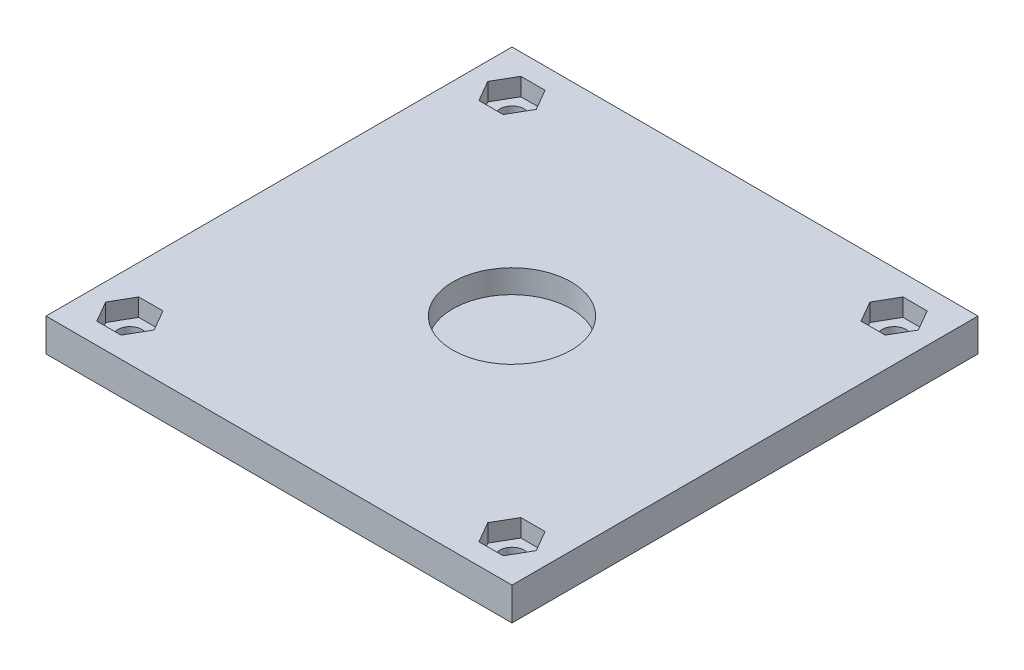
ISO-10303-21;
HEADER;
FILE_DESCRIPTION(('STEP AP214'),'2;1');
FILE_NAME('part.step','',(''),(''),'','','');
FILE_SCHEMA(('AUTOMOTIVE_DESIGN { 1 0 10303 214 1 1 1 1 }'));
ENDSEC;
DATA;
#1=APPLICATION_CONTEXT('core data for automotive mechanical design processes');
#2=APPLICATION_PROTOCOL_DEFINITION('international standard','automotive_design',2000,#1);
#3=PRODUCT_CONTEXT('',#1,'mechanical');
#4=PRODUCT('Part','Part','',(#3));
#5=PRODUCT_RELATED_PRODUCT_CATEGORY('part','',(#4));
#6=PRODUCT_DEFINITION_FORMATION('','',#4);
#7=PRODUCT_DEFINITION_CONTEXT('part definition',#1,'design');
#8=PRODUCT_DEFINITION('design','',#6,#7);
#9=PRODUCT_DEFINITION_SHAPE('','',#8);
#10=(LENGTH_UNIT() NAMED_UNIT(*) SI_UNIT(.MILLI.,.METRE.));
#11=(NAMED_UNIT(*) PLANE_ANGLE_UNIT() SI_UNIT($,.RADIAN.));
#12=(NAMED_UNIT(*) SI_UNIT($,.STERADIAN.) SOLID_ANGLE_UNIT());
#13=UNCERTAINTY_MEASURE_WITH_UNIT(LENGTH_MEASURE(1.E-05),#10,'distance_accuracy_value','');
#14=(GEOMETRIC_REPRESENTATION_CONTEXT(3) GLOBAL_UNCERTAINTY_ASSIGNED_CONTEXT((#13)) GLOBAL_UNIT_ASSIGNED_CONTEXT((#10,
#11,#12)) REPRESENTATION_CONTEXT('',''));
#15=CARTESIAN_POINT('',(0.,0.,0.));
#16=DIRECTION('',(0.,0.,1.));
#17=DIRECTION('',(1.,0.,0.));
#18=AXIS2_PLACEMENT_3D('',#15,#16,#17);
#19=CARTESIAN_POINT('',(8.1303580901857,4.476,26.0013129973475));
#20=DIRECTION('',(0.,0.,-1.));
#21=DIRECTION('',(-1.,0.,0.));
#22=AXIS2_PLACEMENT_3D('',#19,#20,#21);
#23=PLANE('',#22);
#24=DIRECTION('',(1.,0.,0.));
#25=VECTOR('',#24,1.);
#26=CARTESIAN_POINT('',(8.1303580901857,0.,26.0013129973475));
#27=LINE('',#26,#25);
#28=CARTESIAN_POINT('',(8.1303580901857,0.,26.0013129973475));
#29=VERTEX_POINT('',#28);
#30=CARTESIAN_POINT('',(71.6303580901857,0.,26.0013129973475));
#31=VERTEX_POINT('',#30);
#32=EDGE_CURVE('E395',#29,#31,#27,.T.);
#33=ORIENTED_EDGE('',*,*,#32,.T.);
#34=DIRECTION('',(0.,-1.,0.));
#35=VECTOR('',#34,1.);
#36=CARTESIAN_POINT('',(71.6303580901857,4.476,26.0013129973475));
#37=LINE('',#36,#35);
#38=CARTESIAN_POINT('',(71.6303580901857,4.476,26.0013129973475));
#39=VERTEX_POINT('',#38);
#40=EDGE_CURVE('E41',#39,#31,#37,.T.);
#41=ORIENTED_EDGE('',*,*,#40,.F.);
#42=DIRECTION('',(1.,0.,0.));
#43=VECTOR('',#42,1.);
#44=CARTESIAN_POINT('',(8.1303580901857,4.476,26.0013129973475));
#45=LINE('',#44,#43);
#46=CARTESIAN_POINT('',(8.1303580901857,4.476,26.0013129973475));
#47=VERTEX_POINT('',#46);
#48=EDGE_CURVE('E409',#47,#39,#45,.T.);
#49=ORIENTED_EDGE('',*,*,#48,.F.);
#50=DIRECTION('',(0.,-1.,0.));
#51=VECTOR('',#50,1.);
#52=CARTESIAN_POINT('',(8.1303580901857,4.476,26.0013129973475));
#53=LINE('',#52,#51);
#54=EDGE_CURVE('E11',#47,#29,#53,.T.);
#55=ORIENTED_EDGE('',*,*,#54,.T.);
#56=EDGE_LOOP('',(#33,#41,#49,#55));
#57=FACE_BOUND('',#56,.T.);
#58=ADVANCED_FACE('F33',(#57),#23,.F.);
#59=CARTESIAN_POINT('',(71.6303580901857,4.476,-15.9086870026524));
#60=DIRECTION('',(-1.,0.,0.));
#61=DIRECTION('',(0.,0.,1.));
#62=AXIS2_PLACEMENT_3D('',#59,#60,#61);
#63=PLANE('',#62);
#64=DIRECTION('',(0.,0.,-1.));
#65=VECTOR('',#64,1.);
#66=CARTESIAN_POINT('',(71.6303580901857,0.,-15.9086870026524));
#67=LINE('',#66,#65);
#68=CARTESIAN_POINT('',(71.6303580901857,0.,-37.4986870026525));
#69=VERTEX_POINT('',#68);
#70=EDGE_CURVE('E420',#31,#69,#67,.T.);
#71=ORIENTED_EDGE('',*,*,#70,.T.);
#72=DIRECTION('',(0.,-1.,0.));
#73=VECTOR('',#72,1.);
#74=CARTESIAN_POINT('',(71.6303580901857,4.476,-37.4986870026525));
#75=LINE('',#74,#73);
#76=CARTESIAN_POINT('',(71.6303580901857,4.476,-37.4986870026525));
#77=VERTEX_POINT('',#76);
#78=EDGE_CURVE('E428',#77,#69,#75,.T.);
#79=ORIENTED_EDGE('',*,*,#78,.F.);
#80=DIRECTION('',(0.,0.,-1.));
#81=VECTOR('',#80,1.);
#82=CARTESIAN_POINT('',(71.6303580901857,4.476,26.0013129973475));
#83=LINE('',#82,#81);
#84=EDGE_CURVE('E412',#39,#77,#83,.T.);
#85=ORIENTED_EDGE('',*,*,#84,.F.);
#86=ORIENTED_EDGE('',*,*,#40,.T.);
#87=EDGE_LOOP('',(#71,#79,#85,#86));
#88=FACE_BOUND('',#87,.T.);
#89=ADVANCED_FACE('F494',(#88),#63,.F.);
#90=CARTESIAN_POINT('',(71.6303580901857,4.476,-37.4986870026525));
#91=DIRECTION('',(0.,0.,1.));
#92=DIRECTION('',(1.,0.,0.));
#93=AXIS2_PLACEMENT_3D('',#90,#91,#92);
#94=PLANE('',#93);
#95=DIRECTION('',(-1.,0.,0.));
#96=VECTOR('',#95,1.);
#97=CARTESIAN_POINT('',(71.6303580901857,0.,-37.4986870026525));
#98=LINE('',#97,#96);
#99=CARTESIAN_POINT('',(8.13035809018569,0.,-37.4986870026525));
#100=VERTEX_POINT('',#99);
#101=EDGE_CURVE('E422',#69,#100,#98,.T.);
#102=ORIENTED_EDGE('',*,*,#101,.T.);
#103=DIRECTION('',(0.,-1.,0.));
#104=VECTOR('',#103,1.);
#105=CARTESIAN_POINT('',(8.13035809018569,4.476,-37.4986870026525));
#106=LINE('',#105,#104);
#107=CARTESIAN_POINT('',(8.13035809018569,4.476,-37.4986870026525));
#108=VERTEX_POINT('',#107);
#109=EDGE_CURVE('E417',#108,#100,#106,.T.);
#110=ORIENTED_EDGE('',*,*,#109,.F.);
#111=DIRECTION('',(-1.,0.,0.));
#112=VECTOR('',#111,1.);
#113=CARTESIAN_POINT('',(71.6303580901857,4.476,-37.4986870026525));
#114=LINE('',#113,#112);
#115=EDGE_CURVE('E414',#77,#108,#114,.T.);
#116=ORIENTED_EDGE('',*,*,#115,.F.);
#117=ORIENTED_EDGE('',*,*,#78,.T.);
#118=EDGE_LOOP('',(#102,#110,#116,#117));
#119=FACE_BOUND('',#118,.T.);
#120=ADVANCED_FACE('F499',(#119),#94,.F.);
#121=CARTESIAN_POINT('',(8.13035809018569,4.476,19.6513129973474));
#122=DIRECTION('',(1.,0.,0.));
#123=DIRECTION('',(0.,0.,-1.));
#124=AXIS2_PLACEMENT_3D('',#121,#122,#123);
#125=PLANE('',#124);
#126=DIRECTION('',(0.,0.,1.));
#127=VECTOR('',#126,1.);
#128=CARTESIAN_POINT('',(8.13035809018569,0.,19.6513129973474));
#129=LINE('',#128,#127);
#130=EDGE_CURVE('E410',#100,#29,#129,.T.);
#131=ORIENTED_EDGE('',*,*,#130,.T.);
#132=ORIENTED_EDGE('',*,*,#54,.F.);
#133=DIRECTION('',(0.,0.,1.));
#134=VECTOR('',#133,1.);
#135=CARTESIAN_POINT('',(8.13035809018569,4.476,19.6513129973474));
#136=LINE('',#135,#134);
#137=EDGE_CURVE('E406',#108,#47,#136,.T.);
#138=ORIENTED_EDGE('',*,*,#137,.F.);
#139=ORIENTED_EDGE('',*,*,#109,.T.);
#140=EDGE_LOOP('',(#131,#132,#138,#139));
#141=FACE_BOUND('',#140,.T.);
#142=ADVANCED_FACE('F511',(#141),#125,.F.);
#143=CARTESIAN_POINT('',(0.,4.476,0.));
#144=DIRECTION('',(0.,1.,0.));
#145=DIRECTION('',(0.,0.,1.));
#146=AXIS2_PLACEMENT_3D('',#143,#144,#145);
#147=PLANE('',#146);
#148=CARTESIAN_POINT('',(39.8803580901857,4.476,-5.74868700265251));
#149=DIRECTION('',(0.,1.,0.));
#150=DIRECTION('',(0.,0.,1.));
#151=AXIS2_PLACEMENT_3D('',#148,#149,#150);
#152=CIRCLE('',#151,8.0645);
#153=CARTESIAN_POINT('',(39.8803580901857,4.476,2.31581299734749));
#154=VERTEX_POINT('',#153);
#155=EDGE_CURVE('E893',#154,#154,#152,.T.);
#156=ORIENTED_EDGE('',*,*,#155,.F.);
#157=EDGE_LOOP('',(#156));
#158=FACE_BOUND('',#157,.T.);
#159=DIRECTION('',(0.499999999999999,0.,-0.866025403784439));
#160=VECTOR('',#159,1.);
#161=CARTESIAN_POINT('',(21.6429173613664,4.476,12.4955441646337));
#162=LINE('',#161,#160);
#163=CARTESIAN_POINT('',(15.4951364843956,4.476,23.1438129973475));
#164=VERTEX_POINT('',#163);
#165=CARTESIAN_POINT('',(17.1449148786049,4.476,20.2863129973475));
#166=VERTEX_POINT('',#165);
#167=EDGE_CURVE('E49',#164,#166,#162,.T.);
#168=ORIENTED_EDGE('',*,*,#167,.F.);
#169=DIRECTION('',(1.,0.,0.));
#170=VECTOR('',#169,1.);
#171=CARTESIAN_POINT('',(0.,4.476,23.1438129973475));
#172=LINE('',#171,#170);
#173=CARTESIAN_POINT('',(12.1955796959769,4.476,23.1438129973475));
#174=VERTEX_POINT('',#173);
#175=EDGE_CURVE('E229',#174,#164,#172,.T.);
#176=ORIENTED_EDGE('',*,*,#175,.F.);
#177=DIRECTION('',(0.5,0.,0.866025403784439));
#178=VECTOR('',#177,1.);
#179=CARTESIAN_POINT('',(-0.874880226087025,4.476,0.505112334040024));
#180=LINE('',#179,#178);
#181=CARTESIAN_POINT('',(10.5458013017675,4.476,20.2863129973475));
#182=VERTEX_POINT('',#181);
#183=EDGE_CURVE('E234',#182,#174,#180,.T.);
#184=ORIENTED_EDGE('',*,*,#183,.F.);
#185=DIRECTION('',(-0.5,0.,0.866025403784439));
#186=VECTOR('',#185,1.);
#187=CARTESIAN_POINT('',(16.6935821787383,4.476,9.63804416463371));
#188=LINE('',#187,#186);
#189=CARTESIAN_POINT('',(12.1955796959769,4.476,17.4288129973475));
#190=VERTEX_POINT('',#189);
#191=EDGE_CURVE('E466',#190,#182,#188,.T.);
#192=ORIENTED_EDGE('',*,*,#191,.F.);
#193=DIRECTION('',(-1.,0.,0.));
#194=VECTOR('',#193,1.);
#195=CARTESIAN_POINT('',(0.,4.476,17.4288129973475));
#196=LINE('',#195,#194);
#197=CARTESIAN_POINT('',(15.4951364843956,4.476,17.4288129973475));
#198=VERTEX_POINT('',#197);
#199=EDGE_CURVE('E246',#198,#190,#196,.T.);
#200=ORIENTED_EDGE('',*,*,#199,.F.);
#201=DIRECTION('',(-0.5,0.,-0.866025403784439));
#202=VECTOR('',#201,1.);
#203=CARTESIAN_POINT('',(4.07445495654103,4.476,-2.35238766595997));
#204=LINE('',#203,#202);
#205=EDGE_CURVE('E241',#166,#198,#204,.T.);
#206=ORIENTED_EDGE('',*,*,#205,.F.);
#207=EDGE_LOOP('',(#168,#176,#184,#192,#200,#206));
#208=FACE_BOUND('',#207,.T.);
#209=DIRECTION('',(0.500000000000001,0.,-0.866025403784438));
#210=VECTOR('',#209,1.);
#211=CARTESIAN_POINT('',(60.6954173613663,4.476,35.0425155521616));
#212=LINE('',#211,#210);
#213=CARTESIAN_POINT('',(67.5651364843956,4.476,23.1438129973475));
#214=VERTEX_POINT('',#213);
#215=CARTESIAN_POINT('',(69.2149148786049,4.476,20.2863129973475));
#216=VERTEX_POINT('',#215);
#217=EDGE_CURVE('E57',#214,#216,#212,.T.);
#218=ORIENTED_EDGE('',*,*,#217,.F.);
#219=DIRECTION('',(1.,0.,0.));
#220=VECTOR('',#219,1.);
#221=CARTESIAN_POINT('',(0.,4.476,23.1438129973475));
#222=LINE('',#221,#220);
#223=CARTESIAN_POINT('',(64.2655796959769,4.476,23.1438129973475));
#224=VERTEX_POINT('',#223);
#225=EDGE_CURVE('E276',#224,#214,#222,.T.);
#226=ORIENTED_EDGE('',*,*,#225,.F.);
#227=DIRECTION('',(0.500000000000002,0.,0.866025403784437));
#228=VECTOR('',#227,1.);
#229=CARTESIAN_POINT('',(38.1776197739128,4.476,-22.0418590534879));
#230=LINE('',#229,#228);
#231=CARTESIAN_POINT('',(62.6158013017675,4.476,20.2863129973475));
#232=VERTEX_POINT('',#231);
#233=EDGE_CURVE('E279',#232,#224,#230,.T.);
#234=ORIENTED_EDGE('',*,*,#233,.F.);
#235=DIRECTION('',(-0.500000000000002,0.,0.866025403784437));
#236=VECTOR('',#235,1.);
#237=CARTESIAN_POINT('',(55.7460821787382,4.476,32.1850155521617));
#238=LINE('',#237,#236);
#239=CARTESIAN_POINT('',(64.2655796959769,4.476,17.4288129973475));
#240=VERTEX_POINT('',#239);
#241=EDGE_CURVE('E283',#240,#232,#238,.T.);
#242=ORIENTED_EDGE('',*,*,#241,.F.);
#243=DIRECTION('',(-1.,0.,0.));
#244=VECTOR('',#243,1.);
#245=CARTESIAN_POINT('',(0.,4.476,17.4288129973475));
#246=LINE('',#245,#244);
#247=CARTESIAN_POINT('',(67.5651364843956,4.476,17.4288129973475));
#248=VERTEX_POINT('',#247);
#249=EDGE_CURVE('E286',#248,#240,#246,.T.);
#250=ORIENTED_EDGE('',*,*,#249,.F.);
#251=DIRECTION('',(-0.5,0.,-0.866025403784439));
#252=VECTOR('',#251,1.);
#253=CARTESIAN_POINT('',(43.126954956541,4.476,-24.8993590534878));
#254=LINE('',#253,#252);
#255=EDGE_CURVE('E289',#216,#248,#254,.T.);
#256=ORIENTED_EDGE('',*,*,#255,.F.);
#257=EDGE_LOOP('',(#218,#226,#234,#242,#250,#256));
#258=FACE_BOUND('',#257,.T.);
#259=DIRECTION('',(0.499999999999998,0.,-0.86602540378444));
#260=VECTOR('',#259,1.);
#261=CARTESIAN_POINT('',(38.1484459738383,4.476,22.0250155521613));
#262=LINE('',#261,#260);
#263=CARTESIAN_POINT('',(67.565136484395,4.476,-28.9261870026525));
#264=VERTEX_POINT('',#263);
#265=CARTESIAN_POINT('',(69.2149148786044,4.476,-31.7836870026525));
#266=VERTEX_POINT('',#265);
#267=EDGE_CURVE('E339',#264,#266,#262,.T.);
#268=ORIENTED_EDGE('',*,*,#267,.F.);
#269=DIRECTION('',(1.,0.,0.));
#270=VECTOR('',#269,1.);
#271=CARTESIAN_POINT('',(0.,4.476,-28.9261870026525));
#272=LINE('',#271,#270);
#273=CARTESIAN_POINT('',(64.2655796959763,4.476,-28.9261870026525));
#274=VERTEX_POINT('',#273);
#275=EDGE_CURVE('E323',#274,#264,#272,.T.);
#276=ORIENTED_EDGE('',*,*,#275,.F.);
#277=DIRECTION('',(0.499999999999999,0.,0.866025403784439));
#278=VECTOR('',#277,1.);
#279=CARTESIAN_POINT('',(60.7245911614404,4.476,-35.0593590534875));
#280=LINE('',#279,#278);
#281=CARTESIAN_POINT('',(62.615801301767,4.476,-31.7836870026525));
#282=VERTEX_POINT('',#281);
#283=EDGE_CURVE('E326',#282,#274,#280,.T.);
#284=ORIENTED_EDGE('',*,*,#283,.F.);
#285=DIRECTION('',(-0.499999999999999,0.,0.866025403784439));
#286=VECTOR('',#285,1.);
#287=CARTESIAN_POINT('',(33.1991107912101,4.476,19.1675155521613));
#288=LINE('',#287,#286);
#289=CARTESIAN_POINT('',(64.2655796959763,4.476,-34.6411870026525));
#290=VERTEX_POINT('',#289);
#291=EDGE_CURVE('E330',#290,#282,#288,.T.);
#292=ORIENTED_EDGE('',*,*,#291,.F.);
#293=DIRECTION('',(-1.,0.,0.));
#294=VECTOR('',#293,1.);
#295=CARTESIAN_POINT('',(0.,4.476,-34.6411870026525));
#296=LINE('',#295,#294);
#297=CARTESIAN_POINT('',(67.565136484395,4.476,-34.6411870026525));
#298=VERTEX_POINT('',#297);
#299=EDGE_CURVE('E333',#298,#290,#296,.T.);
#300=ORIENTED_EDGE('',*,*,#299,.F.);
#301=DIRECTION('',(-0.5,0.,-0.866025403784439));
#302=VECTOR('',#301,1.);
#303=CARTESIAN_POINT('',(65.6739263440685,4.476,-37.9168590534876));
#304=LINE('',#303,#302);
#305=EDGE_CURVE('E336',#266,#298,#304,.T.);
#306=ORIENTED_EDGE('',*,*,#305,.F.);
#307=EDGE_LOOP('',(#268,#276,#284,#292,#300,#306));
#308=FACE_BOUND('',#307,.T.);
#309=DIRECTION('',(1.,0.,0.));
#310=VECTOR('',#309,1.);
#311=CARTESIAN_POINT('',(0.,4.476,-28.9261870026525));
#312=LINE('',#311,#310);
#313=CARTESIAN_POINT('',(12.1955796959763,4.476,-28.9261870026525));
#314=VERTEX_POINT('',#313);
#315=CARTESIAN_POINT('',(15.495136484395,4.476,-28.9261870026525));
#316=VERTEX_POINT('',#315);
#317=EDGE_CURVE('E341',#314,#316,#312,.T.);
#318=ORIENTED_EDGE('',*,*,#317,.F.);
#319=DIRECTION('',(0.5,0.,0.866025403784439));
#320=VECTOR('',#319,1.);
#321=CARTESIAN_POINT('',(21.6720911614404,4.476,-12.5123876659597));
#322=LINE('',#321,#320);
#323=CARTESIAN_POINT('',(10.545801301767,4.476,-31.7836870026525));
#324=VERTEX_POINT('',#323);
#325=EDGE_CURVE('E362',#324,#314,#322,.T.);
#326=ORIENTED_EDGE('',*,*,#325,.F.);
#327=DIRECTION('',(-0.5,0.,0.866025403784439));
#328=VECTOR('',#327,1.);
#329=CARTESIAN_POINT('',(-5.85338920878995,4.476,-3.37945583536653));
#330=LINE('',#329,#328);
#331=CARTESIAN_POINT('',(12.1955796959763,4.476,-34.6411870026525));
#332=VERTEX_POINT('',#331);
#333=EDGE_CURVE('E388',#332,#324,#330,.T.);
#334=ORIENTED_EDGE('',*,*,#333,.F.);
#335=DIRECTION('',(-1.,0.,0.));
#336=VECTOR('',#335,1.);
#337=CARTESIAN_POINT('',(0.,4.476,-34.6411870026525));
#338=LINE('',#337,#336);
#339=CARTESIAN_POINT('',(15.4951364843951,4.476,-34.6411870026525));
#340=VERTEX_POINT('',#339);
#341=EDGE_CURVE('E385',#340,#332,#338,.T.);
#342=ORIENTED_EDGE('',*,*,#341,.F.);
#343=DIRECTION('',(-0.5,0.,-0.866025403784439));
#344=VECTOR('',#343,1.);
#345=CARTESIAN_POINT('',(26.6214263440685,4.476,-15.3698876659597));
#346=LINE('',#345,#344);
#347=CARTESIAN_POINT('',(17.1449148786044,4.476,-31.7836870026525));
#348=VERTEX_POINT('',#347);
#349=EDGE_CURVE('E382',#348,#340,#346,.T.);
#350=ORIENTED_EDGE('',*,*,#349,.F.);
#351=DIRECTION('',(0.499999999999999,0.,-0.866025403784439));
#352=VECTOR('',#351,1.);
#353=CARTESIAN_POINT('',(-0.904054026161858,4.476,-0.521955835366512));
#354=LINE('',#353,#352);
#355=EDGE_CURVE('E379',#316,#348,#354,.T.);
#356=ORIENTED_EDGE('',*,*,#355,.F.);
#357=EDGE_LOOP('',(#318,#326,#334,#342,#350,#356));
#358=FACE_BOUND('',#357,.T.);
#359=ORIENTED_EDGE('',*,*,#137,.T.);
#360=ORIENTED_EDGE('',*,*,#48,.T.);
#361=ORIENTED_EDGE('',*,*,#84,.T.);
#362=ORIENTED_EDGE('',*,*,#115,.T.);
#363=EDGE_LOOP('',(#359,#360,#361,#362));
#364=FACE_BOUND('',#363,.T.);
#365=ADVANCED_FACE('F237',(#158,#208,#258,#308,#358,#364),#147,.T.);
#366=CARTESIAN_POINT('',(0.,0.,0.));
#367=DIRECTION('',(0.,1.,0.));
#368=DIRECTION('',(0.,0.,1.));
#369=AXIS2_PLACEMENT_3D('',#366,#367,#368);
#370=PLANE('',#369);
#371=CARTESIAN_POINT('',(13.8453580901862,0.,20.2863129973475));
#372=DIRECTION('',(0.,1.,0.));
#373=DIRECTION('',(0.,0.,1.));
#374=AXIS2_PLACEMENT_3D('',#371,#372,#373);
#375=CIRCLE('',#374,1.65);
#376=CARTESIAN_POINT('',(13.8453580901862,0.,21.9363129973475));
#377=VERTEX_POINT('',#376);
#378=EDGE_CURVE('E451',#377,#377,#375,.T.);
#379=ORIENTED_EDGE('',*,*,#378,.T.);
#380=EDGE_LOOP('',(#379));
#381=FACE_BOUND('',#380,.T.);
#382=CARTESIAN_POINT('',(65.9153580901862,0.,20.2863129973475));
#383=DIRECTION('',(0.,1.,0.));
#384=DIRECTION('',(0.,0.,1.));
#385=AXIS2_PLACEMENT_3D('',#382,#383,#384);
#386=CIRCLE('',#385,1.65);
#387=CARTESIAN_POINT('',(65.9153580901862,0.,21.9363129973475));
#388=VERTEX_POINT('',#387);
#389=EDGE_CURVE('E441',#388,#388,#386,.T.);
#390=ORIENTED_EDGE('',*,*,#389,.T.);
#391=EDGE_LOOP('',(#390));
#392=FACE_BOUND('',#391,.T.);
#393=CARTESIAN_POINT('',(65.9153580901857,0.,-31.7836870026525));
#394=DIRECTION('',(0.,1.,0.));
#395=DIRECTION('',(0.,0.,1.));
#396=AXIS2_PLACEMENT_3D('',#393,#394,#395);
#397=CIRCLE('',#396,1.65);
#398=CARTESIAN_POINT('',(65.9153580901857,0.,-30.1336870026525));
#399=VERTEX_POINT('',#398);
#400=EDGE_CURVE('E438',#399,#399,#397,.T.);
#401=ORIENTED_EDGE('',*,*,#400,.T.);
#402=EDGE_LOOP('',(#401));
#403=FACE_BOUND('',#402,.T.);
#404=CARTESIAN_POINT('',(13.8453580901857,0.,-31.7836870026525));
#405=DIRECTION('',(0.,1.,0.));
#406=DIRECTION('',(0.,0.,1.));
#407=AXIS2_PLACEMENT_3D('',#404,#405,#406);
#408=CIRCLE('',#407,1.65);
#409=CARTESIAN_POINT('',(13.8453580901857,0.,-30.1336870026525));
#410=VERTEX_POINT('',#409);
#411=EDGE_CURVE('E435',#410,#410,#408,.T.);
#412=ORIENTED_EDGE('',*,*,#411,.T.);
#413=EDGE_LOOP('',(#412));
#414=FACE_BOUND('',#413,.T.);
#415=ORIENTED_EDGE('',*,*,#32,.F.);
#416=ORIENTED_EDGE('',*,*,#130,.F.);
#417=ORIENTED_EDGE('',*,*,#101,.F.);
#418=ORIENTED_EDGE('',*,*,#70,.F.);
#419=EDGE_LOOP('',(#415,#416,#417,#418));
#420=FACE_BOUND('',#419,.T.);
#421=ADVANCED_FACE('F513',(#381,#392,#403,#414,#420),#370,.F.);
#422=CARTESIAN_POINT('',(0.,2.063,-28.9261870026525));
#423=DIRECTION('',(0.,0.,1.));
#424=DIRECTION('',(1.,0.,0.));
#425=AXIS2_PLACEMENT_3D('',#422,#423,#424);
#426=PLANE('',#425);
#427=ORIENTED_EDGE('',*,*,#317,.T.);
#428=DIRECTION('',(0.,1.,0.));
#429=VECTOR('',#428,1.);
#430=CARTESIAN_POINT('',(15.495136484395,2.063,-28.9261870026525));
#431=LINE('',#430,#429);
#432=CARTESIAN_POINT('',(15.495136484395,2.063,-28.9261870026525));
#433=VERTEX_POINT('',#432);
#434=EDGE_CURVE('E377',#433,#316,#431,.T.);
#435=ORIENTED_EDGE('',*,*,#434,.F.);
#436=DIRECTION('',(1.,0.,0.));
#437=VECTOR('',#436,1.);
#438=CARTESIAN_POINT('',(0.,2.063,-28.9261870026525));
#439=LINE('',#438,#437);
#440=CARTESIAN_POINT('',(12.1955796959763,2.063,-28.9261870026525));
#441=VERTEX_POINT('',#440);
#442=EDGE_CURVE('E358',#441,#433,#439,.T.);
#443=ORIENTED_EDGE('',*,*,#442,.F.);
#444=DIRECTION('',(0.,1.,0.));
#445=VECTOR('',#444,1.);
#446=CARTESIAN_POINT('',(12.1955796959763,2.063,-28.9261870026525));
#447=LINE('',#446,#445);
#448=EDGE_CURVE('E393',#441,#314,#447,.T.);
#449=ORIENTED_EDGE('',*,*,#448,.T.);
#450=EDGE_LOOP('',(#427,#435,#443,#449));
#451=FACE_BOUND('',#450,.T.);
#452=ADVANCED_FACE('F524',(#451),#426,.F.);
#453=CARTESIAN_POINT('',(21.6720911614404,2.063,-12.5123876659597));
#454=DIRECTION('',(-0.866025403784439,0.,0.5));
#455=DIRECTION('',(0.5,0.,0.866025403784439));
#456=AXIS2_PLACEMENT_3D('',#453,#454,#455);
#457=PLANE('',#456);
#458=ORIENTED_EDGE('',*,*,#325,.T.);
#459=ORIENTED_EDGE('',*,*,#448,.F.);
#460=DIRECTION('',(0.5,0.,0.866025403784439));
#461=VECTOR('',#460,1.);
#462=CARTESIAN_POINT('',(21.6720911614404,2.063,-12.5123876659597));
#463=LINE('',#462,#461);
#464=CARTESIAN_POINT('',(10.545801301767,2.063,-31.7836870026525));
#465=VERTEX_POINT('',#464);
#466=EDGE_CURVE('E374',#465,#441,#463,.T.);
#467=ORIENTED_EDGE('',*,*,#466,.F.);
#468=DIRECTION('',(0.,1.,0.));
#469=VECTOR('',#468,1.);
#470=CARTESIAN_POINT('',(10.545801301767,2.063,-31.7836870026525));
#471=LINE('',#470,#469);
#472=EDGE_CURVE('E396',#465,#324,#471,.T.);
#473=ORIENTED_EDGE('',*,*,#472,.T.);
#474=EDGE_LOOP('',(#458,#459,#467,#473));
#475=FACE_BOUND('',#474,.T.);
#476=ADVANCED_FACE('F531',(#475),#457,.F.);
#477=CARTESIAN_POINT('',(-5.85338920878995,2.063,-3.37945583536653));
#478=DIRECTION('',(-0.866025403784439,0.,-0.5));
#479=DIRECTION('',(-0.5,0.,0.866025403784439));
#480=AXIS2_PLACEMENT_3D('',#477,#478,#479);
#481=PLANE('',#480);
#482=ORIENTED_EDGE('',*,*,#333,.T.);
#483=ORIENTED_EDGE('',*,*,#472,.F.);
#484=DIRECTION('',(-0.5,0.,0.866025403784439));
#485=VECTOR('',#484,1.);
#486=CARTESIAN_POINT('',(-5.85338920878995,2.063,-3.37945583536653));
#487=LINE('',#486,#485);
#488=CARTESIAN_POINT('',(12.1955796959763,2.063,-34.6411870026525));
#489=VERTEX_POINT('',#488);
#490=EDGE_CURVE('E371',#489,#465,#487,.T.);
#491=ORIENTED_EDGE('',*,*,#490,.F.);
#492=DIRECTION('',(0.,1.,0.));
#493=VECTOR('',#492,1.);
#494=CARTESIAN_POINT('',(12.1955796959763,2.063,-34.6411870026525));
#495=LINE('',#494,#493);
#496=EDGE_CURVE('E398',#489,#332,#495,.T.);
#497=ORIENTED_EDGE('',*,*,#496,.T.);
#498=EDGE_LOOP('',(#482,#483,#491,#497));
#499=FACE_BOUND('',#498,.T.);
#500=ADVANCED_FACE('F545',(#499),#481,.F.);
#501=CARTESIAN_POINT('',(0.,2.063,-34.6411870026525));
#502=DIRECTION('',(0.,0.,-1.));
#503=DIRECTION('',(-1.,0.,0.));
#504=AXIS2_PLACEMENT_3D('',#501,#502,#503);
#505=PLANE('',#504);
#506=ORIENTED_EDGE('',*,*,#341,.T.);
#507=ORIENTED_EDGE('',*,*,#496,.F.);
#508=DIRECTION('',(-1.,0.,0.));
#509=VECTOR('',#508,1.);
#510=CARTESIAN_POINT('',(0.,2.063,-34.6411870026525));
#511=LINE('',#510,#509);
#512=CARTESIAN_POINT('',(15.4951364843951,2.063,-34.6411870026525));
#513=VERTEX_POINT('',#512);
#514=EDGE_CURVE('E368',#513,#489,#511,.T.);
#515=ORIENTED_EDGE('',*,*,#514,.F.);
#516=DIRECTION('',(0.,1.,0.));
#517=VECTOR('',#516,1.);
#518=CARTESIAN_POINT('',(15.4951364843951,2.063,-34.6411870026525));
#519=LINE('',#518,#517);
#520=EDGE_CURVE('E400',#513,#340,#519,.T.);
#521=ORIENTED_EDGE('',*,*,#520,.T.);
#522=EDGE_LOOP('',(#506,#507,#515,#521));
#523=FACE_BOUND('',#522,.T.);
#524=ADVANCED_FACE('F541',(#523),#505,.F.);
#525=CARTESIAN_POINT('',(26.6214263440685,2.063,-15.3698876659597));
#526=DIRECTION('',(0.866025403784438,0.,-0.5));
#527=DIRECTION('',(-0.5,0.,-0.866025403784439));
#528=AXIS2_PLACEMENT_3D('',#525,#526,#527);
#529=PLANE('',#528);
#530=ORIENTED_EDGE('',*,*,#349,.T.);
#531=ORIENTED_EDGE('',*,*,#520,.F.);
#532=DIRECTION('',(-0.5,0.,-0.866025403784439));
#533=VECTOR('',#532,1.);
#534=CARTESIAN_POINT('',(26.6214263440685,2.063,-15.3698876659597));
#535=LINE('',#534,#533);
#536=CARTESIAN_POINT('',(17.1449148786044,2.063,-31.7836870026525));
#537=VERTEX_POINT('',#536);
#538=EDGE_CURVE('E365',#537,#513,#535,.T.);
#539=ORIENTED_EDGE('',*,*,#538,.F.);
#540=DIRECTION('',(0.,1.,0.));
#541=VECTOR('',#540,1.);
#542=CARTESIAN_POINT('',(17.1449148786044,2.063,-31.7836870026525));
#543=LINE('',#542,#541);
#544=EDGE_CURVE('E402',#537,#348,#543,.T.);
#545=ORIENTED_EDGE('',*,*,#544,.T.);
#546=EDGE_LOOP('',(#530,#531,#539,#545));
#547=FACE_BOUND('',#546,.T.);
#548=ADVANCED_FACE('F537',(#547),#529,.F.);
#549=CARTESIAN_POINT('',(-0.904054026161858,2.063,-0.521955835366512));
#550=DIRECTION('',(0.866025403784439,0.,0.499999999999999));
#551=DIRECTION('',(0.499999999999999,0.,-0.866025403784439));
#552=AXIS2_PLACEMENT_3D('',#549,#550,#551);
#553=PLANE('',#552);
#554=ORIENTED_EDGE('',*,*,#355,.T.);
#555=ORIENTED_EDGE('',*,*,#544,.F.);
#556=DIRECTION('',(0.499999999999999,0.,-0.866025403784439));
#557=VECTOR('',#556,1.);
#558=CARTESIAN_POINT('',(-0.904054026161858,2.063,-0.521955835366512));
#559=LINE('',#558,#557);
#560=EDGE_CURVE('E361',#433,#537,#559,.T.);
#561=ORIENTED_EDGE('',*,*,#560,.F.);
#562=ORIENTED_EDGE('',*,*,#434,.T.);
#563=EDGE_LOOP('',(#554,#555,#561,#562));
#564=FACE_BOUND('',#563,.T.);
#565=ADVANCED_FACE('F533',(#564),#553,.F.);
#566=CARTESIAN_POINT('',(0.,2.063,0.));
#567=DIRECTION('',(0.,1.,0.));
#568=DIRECTION('',(0.,0.,1.));
#569=AXIS2_PLACEMENT_3D('',#566,#567,#568);
#570=PLANE('',#569);
#571=CARTESIAN_POINT('',(13.8453580901857,2.063,-31.7836870026525));
#572=DIRECTION('',(0.,1.,0.));
#573=DIRECTION('',(0.,0.,1.));
#574=AXIS2_PLACEMENT_3D('',#571,#572,#573);
#575=CIRCLE('',#574,1.65);
#576=CARTESIAN_POINT('',(13.8453580901857,2.063,-30.1336870026525));
#577=VERTEX_POINT('',#576);
#578=EDGE_CURVE('E226',#577,#577,#575,.T.);
#579=ORIENTED_EDGE('',*,*,#578,.F.);
#580=EDGE_LOOP('',(#579));
#581=FACE_BOUND('',#580,.T.);
#582=ORIENTED_EDGE('',*,*,#442,.T.);
#583=ORIENTED_EDGE('',*,*,#560,.T.);
#584=ORIENTED_EDGE('',*,*,#538,.T.);
#585=ORIENTED_EDGE('',*,*,#514,.T.);
#586=ORIENTED_EDGE('',*,*,#490,.T.);
#587=ORIENTED_EDGE('',*,*,#466,.T.);
#588=EDGE_LOOP('',(#582,#583,#584,#585,#586,#587));
#589=FACE_BOUND('',#588,.T.);
#590=ADVANCED_FACE('F536',(#581,#589),#570,.T.);
#591=CARTESIAN_POINT('',(38.1484459738383,2.063,22.0250155521613));
#592=DIRECTION('',(0.86602540378444,0.,0.499999999999998));
#593=DIRECTION('',(0.499999999999998,0.,-0.86602540378444));
#594=AXIS2_PLACEMENT_3D('',#591,#592,#593);
#595=PLANE('',#594);
#596=ORIENTED_EDGE('',*,*,#267,.T.);
#597=DIRECTION('',(0.,1.,0.));
#598=VECTOR('',#597,1.);
#599=CARTESIAN_POINT('',(69.2149148786044,2.063,-31.7836870026525));
#600=LINE('',#599,#598);
#601=CARTESIAN_POINT('',(69.2149148786044,2.063,-31.7836870026525));
#602=VERTEX_POINT('',#601);
#603=EDGE_CURVE('E310',#602,#266,#600,.T.);
#604=ORIENTED_EDGE('',*,*,#603,.F.);
#605=DIRECTION('',(0.499999999999998,0.,-0.86602540378444));
#606=VECTOR('',#605,1.);
#607=CARTESIAN_POINT('',(38.1484459738383,2.063,22.0250155521613));
#608=LINE('',#607,#606);
#609=CARTESIAN_POINT('',(67.565136484395,2.063,-28.9261870026525));
#610=VERTEX_POINT('',#609);
#611=EDGE_CURVE('E327',#610,#602,#608,.T.);
#612=ORIENTED_EDGE('',*,*,#611,.F.);
#613=DIRECTION('',(0.,1.,0.));
#614=VECTOR('',#613,1.);
#615=CARTESIAN_POINT('',(67.565136484395,2.063,-28.9261870026525));
#616=LINE('',#615,#614);
#617=EDGE_CURVE('E293',#610,#264,#616,.T.);
#618=ORIENTED_EDGE('',*,*,#617,.T.);
#619=EDGE_LOOP('',(#596,#604,#612,#618));
#620=FACE_BOUND('',#619,.T.);
#621=ADVANCED_FACE('F555',(#620),#595,.F.);
#622=CARTESIAN_POINT('',(0.,2.063,-28.9261870026525));
#623=DIRECTION('',(0.,0.,1.));
#624=DIRECTION('',(1.,0.,0.));
#625=AXIS2_PLACEMENT_3D('',#622,#623,#624);
#626=PLANE('',#625);
#627=ORIENTED_EDGE('',*,*,#275,.T.);
#628=ORIENTED_EDGE('',*,*,#617,.F.);
#629=DIRECTION('',(1.,0.,0.));
#630=VECTOR('',#629,1.);
#631=CARTESIAN_POINT('',(0.,2.063,-28.9261870026525));
#632=LINE('',#631,#630);
#633=CARTESIAN_POINT('',(64.2655796959763,2.063,-28.9261870026525));
#634=VERTEX_POINT('',#633);
#635=EDGE_CURVE('E313',#634,#610,#632,.T.);
#636=ORIENTED_EDGE('',*,*,#635,.F.);
#637=DIRECTION('',(0.,1.,0.));
#638=VECTOR('',#637,1.);
#639=CARTESIAN_POINT('',(64.2655796959763,2.063,-28.9261870026525));
#640=LINE('',#639,#638);
#641=EDGE_CURVE('E320',#634,#274,#640,.T.);
#642=ORIENTED_EDGE('',*,*,#641,.T.);
#643=EDGE_LOOP('',(#627,#628,#636,#642));
#644=FACE_BOUND('',#643,.T.);
#645=ADVANCED_FACE('F563',(#644),#626,.F.);
#646=CARTESIAN_POINT('',(60.7245911614404,2.063,-35.0593590534875));
#647=DIRECTION('',(-0.866025403784439,0.,0.499999999999999));
#648=DIRECTION('',(0.499999999999999,0.,0.866025403784439));
#649=AXIS2_PLACEMENT_3D('',#646,#647,#648);
#650=PLANE('',#649);
#651=ORIENTED_EDGE('',*,*,#283,.T.);
#652=ORIENTED_EDGE('',*,*,#641,.F.);
#653=DIRECTION('',(0.499999999999999,0.,0.866025403784439));
#654=VECTOR('',#653,1.);
#655=CARTESIAN_POINT('',(60.7245911614404,2.063,-35.0593590534875));
#656=LINE('',#655,#654);
#657=CARTESIAN_POINT('',(62.615801301767,2.063,-31.7836870026525));
#658=VERTEX_POINT('',#657);
#659=EDGE_CURVE('E344',#658,#634,#656,.T.);
#660=ORIENTED_EDGE('',*,*,#659,.F.);
#661=DIRECTION('',(0.,1.,0.));
#662=VECTOR('',#661,1.);
#663=CARTESIAN_POINT('',(62.615801301767,2.063,-31.7836870026525));
#664=LINE('',#663,#662);
#665=EDGE_CURVE('E318',#658,#282,#664,.T.);
#666=ORIENTED_EDGE('',*,*,#665,.T.);
#667=EDGE_LOOP('',(#651,#652,#660,#666));
#668=FACE_BOUND('',#667,.T.);
#669=ADVANCED_FACE('F566',(#668),#650,.F.);
#670=CARTESIAN_POINT('',(33.1991107912101,2.063,19.1675155521613));
#671=DIRECTION('',(-0.866025403784439,0.,-0.499999999999999));
#672=DIRECTION('',(-0.499999999999999,0.,0.866025403784439));
#673=AXIS2_PLACEMENT_3D('',#670,#671,#672);
#674=PLANE('',#673);
#675=ORIENTED_EDGE('',*,*,#291,.T.);
#676=ORIENTED_EDGE('',*,*,#665,.F.);
#677=DIRECTION('',(-0.499999999999999,0.,0.866025403784439));
#678=VECTOR('',#677,1.);
#679=CARTESIAN_POINT('',(33.1991107912101,2.063,19.1675155521613));
#680=LINE('',#679,#678);
#681=CARTESIAN_POINT('',(64.2655796959763,2.063,-34.6411870026525));
#682=VERTEX_POINT('',#681);
#683=EDGE_CURVE('E347',#682,#658,#680,.T.);
#684=ORIENTED_EDGE('',*,*,#683,.F.);
#685=DIRECTION('',(0.,1.,0.));
#686=VECTOR('',#685,1.);
#687=CARTESIAN_POINT('',(64.2655796959763,2.063,-34.6411870026525));
#688=LINE('',#687,#686);
#689=EDGE_CURVE('E316',#682,#290,#688,.T.);
#690=ORIENTED_EDGE('',*,*,#689,.T.);
#691=EDGE_LOOP('',(#675,#676,#684,#690));
#692=FACE_BOUND('',#691,.T.);
#693=ADVANCED_FACE('F570',(#692),#674,.F.);
#694=CARTESIAN_POINT('',(0.,2.063,-34.6411870026525));
#695=DIRECTION('',(0.,0.,-1.));
#696=DIRECTION('',(-1.,0.,0.));
#697=AXIS2_PLACEMENT_3D('',#694,#695,#696);
#698=PLANE('',#697);
#699=ORIENTED_EDGE('',*,*,#299,.T.);
#700=ORIENTED_EDGE('',*,*,#689,.F.);
#701=DIRECTION('',(-1.,0.,0.));
#702=VECTOR('',#701,1.);
#703=CARTESIAN_POINT('',(0.,2.063,-34.6411870026525));
#704=LINE('',#703,#702);
#705=CARTESIAN_POINT('',(67.565136484395,2.063,-34.6411870026525));
#706=VERTEX_POINT('',#705);
#707=EDGE_CURVE('E350',#706,#682,#704,.T.);
#708=ORIENTED_EDGE('',*,*,#707,.F.);
#709=DIRECTION('',(0.,1.,0.));
#710=VECTOR('',#709,1.);
#711=CARTESIAN_POINT('',(67.565136484395,2.063,-34.6411870026525));
#712=LINE('',#711,#710);
#713=EDGE_CURVE('E314',#706,#298,#712,.T.);
#714=ORIENTED_EDGE('',*,*,#713,.T.);
#715=EDGE_LOOP('',(#699,#700,#708,#714));
#716=FACE_BOUND('',#715,.T.);
#717=ADVANCED_FACE('F574',(#716),#698,.F.);
#718=CARTESIAN_POINT('',(65.6739263440685,2.063,-37.9168590534876));
#719=DIRECTION('',(0.866025403784439,0.,-0.5));
#720=DIRECTION('',(-0.5,0.,-0.866025403784439));
#721=AXIS2_PLACEMENT_3D('',#718,#719,#720);
#722=PLANE('',#721);
#723=ORIENTED_EDGE('',*,*,#305,.T.);
#724=ORIENTED_EDGE('',*,*,#713,.F.);
#725=DIRECTION('',(-0.5,0.,-0.866025403784439));
#726=VECTOR('',#725,1.);
#727=CARTESIAN_POINT('',(65.6739263440685,2.063,-37.9168590534876));
#728=LINE('',#727,#726);
#729=EDGE_CURVE('E353',#602,#706,#728,.T.);
#730=ORIENTED_EDGE('',*,*,#729,.F.);
#731=ORIENTED_EDGE('',*,*,#603,.T.);
#732=EDGE_LOOP('',(#723,#724,#730,#731));
#733=FACE_BOUND('',#732,.T.);
#734=ADVANCED_FACE('F561',(#733),#722,.F.);
#735=CARTESIAN_POINT('',(0.,2.063,0.));
#736=DIRECTION('',(0.,1.,0.));
#737=DIRECTION('',(0.,0.,1.));
#738=AXIS2_PLACEMENT_3D('',#735,#736,#737);
#739=PLANE('',#738);
#740=CARTESIAN_POINT('',(65.9153580901857,2.063,-31.7836870026525));
#741=DIRECTION('',(0.,1.,0.));
#742=DIRECTION('',(0.,0.,1.));
#743=AXIS2_PLACEMENT_3D('',#740,#741,#742);
#744=CIRCLE('',#743,1.65);
#745=CARTESIAN_POINT('',(65.9153580901857,2.063,-30.1336870026525));
#746=VERTEX_POINT('',#745);
#747=EDGE_CURVE('E436',#746,#746,#744,.T.);
#748=ORIENTED_EDGE('',*,*,#747,.F.);
#749=EDGE_LOOP('',(#748));
#750=FACE_BOUND('',#749,.T.);
#751=ORIENTED_EDGE('',*,*,#611,.T.);
#752=ORIENTED_EDGE('',*,*,#729,.T.);
#753=ORIENTED_EDGE('',*,*,#707,.T.);
#754=ORIENTED_EDGE('',*,*,#683,.T.);
#755=ORIENTED_EDGE('',*,*,#659,.T.);
#756=ORIENTED_EDGE('',*,*,#635,.T.);
#757=EDGE_LOOP('',(#751,#752,#753,#754,#755,#756));
#758=FACE_BOUND('',#757,.T.);
#759=ADVANCED_FACE('F557',(#750,#758),#739,.T.);
#760=CARTESIAN_POINT('',(60.6954173613663,2.063,35.0425155521616));
#761=DIRECTION('',(0.866025403784438,0.,0.500000000000001));
#762=DIRECTION('',(0.500000000000001,0.,-0.866025403784438));
#763=AXIS2_PLACEMENT_3D('',#760,#761,#762);
#764=PLANE('',#763);
#765=ORIENTED_EDGE('',*,*,#217,.T.);
#766=DIRECTION('',(0.,1.,0.));
#767=VECTOR('',#766,1.);
#768=CARTESIAN_POINT('',(69.2149148786049,2.063,20.2863129973475));
#769=LINE('',#768,#767);
#770=CARTESIAN_POINT('',(69.2149148786049,2.063,20.2863129973475));
#771=VERTEX_POINT('',#770);
#772=EDGE_CURVE('E266',#771,#216,#769,.T.);
#773=ORIENTED_EDGE('',*,*,#772,.F.);
#774=DIRECTION('',(0.500000000000001,0.,-0.866025403784438));
#775=VECTOR('',#774,1.);
#776=CARTESIAN_POINT('',(60.6954173613663,2.063,35.0425155521616));
#777=LINE('',#776,#775);
#778=CARTESIAN_POINT('',(67.5651364843956,2.063,23.1438129973475));
#779=VERTEX_POINT('',#778);
#780=EDGE_CURVE('E280',#779,#771,#777,.T.);
#781=ORIENTED_EDGE('',*,*,#780,.F.);
#782=DIRECTION('',(0.,1.,0.));
#783=VECTOR('',#782,1.);
#784=CARTESIAN_POINT('',(67.5651364843956,2.063,23.1438129973475));
#785=LINE('',#784,#783);
#786=EDGE_CURVE('E242',#779,#214,#785,.T.);
#787=ORIENTED_EDGE('',*,*,#786,.T.);
#788=EDGE_LOOP('',(#765,#773,#781,#787));
#789=FACE_BOUND('',#788,.T.);
#790=ADVANCED_FACE('F560',(#789),#764,.F.);
#791=CARTESIAN_POINT('',(0.,2.063,23.1438129973475));
#792=DIRECTION('',(0.,0.,1.));
#793=DIRECTION('',(1.,0.,0.));
#794=AXIS2_PLACEMENT_3D('',#791,#792,#793);
#795=PLANE('',#794);
#796=ORIENTED_EDGE('',*,*,#225,.T.);
#797=ORIENTED_EDGE('',*,*,#786,.F.);
#798=DIRECTION('',(1.,0.,0.));
#799=VECTOR('',#798,1.);
#800=CARTESIAN_POINT('',(0.,2.063,23.1438129973475));
#801=LINE('',#800,#799);
#802=CARTESIAN_POINT('',(64.2655796959769,2.063,23.1438129973475));
#803=VERTEX_POINT('',#802);
#804=EDGE_CURVE('E268',#803,#779,#801,.T.);
#805=ORIENTED_EDGE('',*,*,#804,.F.);
#806=DIRECTION('',(0.,1.,0.));
#807=VECTOR('',#806,1.);
#808=CARTESIAN_POINT('',(64.2655796959769,2.063,23.1438129973475));
#809=LINE('',#808,#807);
#810=EDGE_CURVE('E244',#803,#224,#809,.T.);
#811=ORIENTED_EDGE('',*,*,#810,.T.);
#812=EDGE_LOOP('',(#796,#797,#805,#811));
#813=FACE_BOUND('',#812,.T.);
#814=ADVANCED_FACE('F590',(#813),#795,.F.);
#815=CARTESIAN_POINT('',(38.1776197739128,2.063,-22.0418590534879));
#816=DIRECTION('',(-0.866025403784438,0.,0.500000000000002));
#817=DIRECTION('',(0.500000000000002,0.,0.866025403784438));
#818=AXIS2_PLACEMENT_3D('',#815,#816,#817);
#819=PLANE('',#818);
#820=ORIENTED_EDGE('',*,*,#233,.T.);
#821=ORIENTED_EDGE('',*,*,#810,.F.);
#822=DIRECTION('',(0.500000000000002,0.,0.866025403784437));
#823=VECTOR('',#822,1.);
#824=CARTESIAN_POINT('',(38.1776197739128,2.063,-22.0418590534879));
#825=LINE('',#824,#823);
#826=CARTESIAN_POINT('',(62.6158013017675,2.063,20.2863129973475));
#827=VERTEX_POINT('',#826);
#828=EDGE_CURVE('E296',#827,#803,#825,.T.);
#829=ORIENTED_EDGE('',*,*,#828,.F.);
#830=DIRECTION('',(0.,1.,0.));
#831=VECTOR('',#830,1.);
#832=CARTESIAN_POINT('',(62.6158013017675,2.063,20.2863129973475));
#833=LINE('',#832,#831);
#834=EDGE_CURVE('E273',#827,#232,#833,.T.);
#835=ORIENTED_EDGE('',*,*,#834,.T.);
#836=EDGE_LOOP('',(#820,#821,#829,#835));
#837=FACE_BOUND('',#836,.T.);
#838=ADVANCED_FACE('F593',(#837),#819,.F.);
#839=CARTESIAN_POINT('',(55.7460821787382,2.063,32.1850155521617));
#840=DIRECTION('',(-0.866025403784438,0.,-0.500000000000002));
#841=DIRECTION('',(-0.500000000000002,0.,0.866025403784438));
#842=AXIS2_PLACEMENT_3D('',#839,#840,#841);
#843=PLANE('',#842);
#844=ORIENTED_EDGE('',*,*,#241,.T.);
#845=ORIENTED_EDGE('',*,*,#834,.F.);
#846=DIRECTION('',(-0.500000000000002,0.,0.866025403784437));
#847=VECTOR('',#846,1.);
#848=CARTESIAN_POINT('',(55.7460821787382,2.063,32.1850155521617));
#849=LINE('',#848,#847);
#850=CARTESIAN_POINT('',(64.2655796959769,2.063,17.4288129973475));
#851=VERTEX_POINT('',#850);
#852=EDGE_CURVE('E299',#851,#827,#849,.T.);
#853=ORIENTED_EDGE('',*,*,#852,.F.);
#854=DIRECTION('',(0.,1.,0.));
#855=VECTOR('',#854,1.);
#856=CARTESIAN_POINT('',(64.2655796959769,2.063,17.4288129973475));
#857=LINE('',#856,#855);
#858=EDGE_CURVE('E271',#851,#240,#857,.T.);
#859=ORIENTED_EDGE('',*,*,#858,.T.);
#860=EDGE_LOOP('',(#844,#845,#853,#859));
#861=FACE_BOUND('',#860,.T.);
#862=ADVANCED_FACE('F597',(#861),#843,.F.);
#863=CARTESIAN_POINT('',(0.,2.063,17.4288129973475));
#864=DIRECTION('',(0.,0.,-1.));
#865=DIRECTION('',(-1.,0.,0.));
#866=AXIS2_PLACEMENT_3D('',#863,#864,#865);
#867=PLANE('',#866);
#868=ORIENTED_EDGE('',*,*,#249,.T.);
#869=ORIENTED_EDGE('',*,*,#858,.F.);
#870=DIRECTION('',(-1.,0.,0.));
#871=VECTOR('',#870,1.);
#872=CARTESIAN_POINT('',(0.,2.063,17.4288129973475));
#873=LINE('',#872,#871);
#874=CARTESIAN_POINT('',(67.5651364843956,2.063,17.4288129973475));
#875=VERTEX_POINT('',#874);
#876=EDGE_CURVE('E302',#875,#851,#873,.T.);
#877=ORIENTED_EDGE('',*,*,#876,.F.);
#878=DIRECTION('',(0.,1.,0.));
#879=VECTOR('',#878,1.);
#880=CARTESIAN_POINT('',(67.5651364843956,2.063,17.4288129973475));
#881=LINE('',#880,#879);
#882=EDGE_CURVE('E269',#875,#248,#881,.T.);
#883=ORIENTED_EDGE('',*,*,#882,.T.);
#884=EDGE_LOOP('',(#868,#869,#877,#883));
#885=FACE_BOUND('',#884,.T.);
#886=ADVANCED_FACE('F601',(#885),#867,.F.);
#887=CARTESIAN_POINT('',(43.126954956541,2.063,-24.8993590534878));
#888=DIRECTION('',(0.866025403784439,0.,-0.5));
#889=DIRECTION('',(-0.5,0.,-0.866025403784439));
#890=AXIS2_PLACEMENT_3D('',#887,#888,#889);
#891=PLANE('',#890);
#892=ORIENTED_EDGE('',*,*,#255,.T.);
#893=ORIENTED_EDGE('',*,*,#882,.F.);
#894=DIRECTION('',(-0.5,0.,-0.866025403784439));
#895=VECTOR('',#894,1.);
#896=CARTESIAN_POINT('',(43.126954956541,2.063,-24.8993590534878));
#897=LINE('',#896,#895);
#898=EDGE_CURVE('E305',#771,#875,#897,.T.);
#899=ORIENTED_EDGE('',*,*,#898,.F.);
#900=ORIENTED_EDGE('',*,*,#772,.T.);
#901=EDGE_LOOP('',(#892,#893,#899,#900));
#902=FACE_BOUND('',#901,.T.);
#903=ADVANCED_FACE('F588',(#902),#891,.F.);
#904=CARTESIAN_POINT('',(0.,2.063,0.));
#905=DIRECTION('',(0.,1.,0.));
#906=DIRECTION('',(0.,0.,1.));
#907=AXIS2_PLACEMENT_3D('',#904,#905,#906);
#908=PLANE('',#907);
#909=CARTESIAN_POINT('',(65.9153580901862,2.063,20.2863129973475));
#910=DIRECTION('',(0.,1.,0.));
#911=DIRECTION('',(0.,0.,1.));
#912=AXIS2_PLACEMENT_3D('',#909,#910,#911);
#913=CIRCLE('',#912,1.65);
#914=CARTESIAN_POINT('',(65.9153580901862,2.063,21.9363129973475));
#915=VERTEX_POINT('',#914);
#916=EDGE_CURVE('E439',#915,#915,#913,.T.);
#917=ORIENTED_EDGE('',*,*,#916,.F.);
#918=EDGE_LOOP('',(#917));
#919=FACE_BOUND('',#918,.T.);
#920=ORIENTED_EDGE('',*,*,#780,.T.);
#921=ORIENTED_EDGE('',*,*,#898,.T.);
#922=ORIENTED_EDGE('',*,*,#876,.T.);
#923=ORIENTED_EDGE('',*,*,#852,.T.);
#924=ORIENTED_EDGE('',*,*,#828,.T.);
#925=ORIENTED_EDGE('',*,*,#804,.T.);
#926=EDGE_LOOP('',(#920,#921,#922,#923,#924,#925));
#927=FACE_BOUND('',#926,.T.);
#928=ADVANCED_FACE('F585',(#919,#927),#908,.T.);
#929=CARTESIAN_POINT('',(21.6429173613664,2.063,12.4955441646337));
#930=DIRECTION('',(0.866025403784439,0.,0.499999999999999));
#931=DIRECTION('',(0.499999999999999,0.,-0.866025403784439));
#932=AXIS2_PLACEMENT_3D('',#929,#930,#931);
#933=PLANE('',#932);
#934=ORIENTED_EDGE('',*,*,#167,.T.);
#935=DIRECTION('',(0.,1.,0.));
#936=VECTOR('',#935,1.);
#937=CARTESIAN_POINT('',(17.144914878605,2.063,20.2863129973475));
#938=LINE('',#937,#936);
#939=CARTESIAN_POINT('',(17.144914878605,2.063,20.2863129973475));
#940=VERTEX_POINT('',#939);
#941=EDGE_CURVE('E253',#940,#166,#938,.T.);
#942=ORIENTED_EDGE('',*,*,#941,.F.);
#943=DIRECTION('',(0.499999999999999,0.,-0.866025403784439));
#944=VECTOR('',#943,1.);
#945=CARTESIAN_POINT('',(21.6429173613664,2.063,12.4955441646337));
#946=LINE('',#945,#944);
#947=CARTESIAN_POINT('',(15.4951364843956,2.063,23.1438129973475));
#948=VERTEX_POINT('',#947);
#949=EDGE_CURVE('E221',#948,#940,#946,.T.);
#950=ORIENTED_EDGE('',*,*,#949,.F.);
#951=DIRECTION('',(0.,1.,0.));
#952=VECTOR('',#951,1.);
#953=CARTESIAN_POINT('',(15.4951364843956,2.063,23.1438129973475));
#954=LINE('',#953,#952);
#955=EDGE_CURVE('E217',#948,#164,#954,.T.);
#956=ORIENTED_EDGE('',*,*,#955,.T.);
#957=EDGE_LOOP('',(#934,#942,#950,#956));
#958=FACE_BOUND('',#957,.T.);
#959=ADVANCED_FACE('F219',(#958),#933,.F.);
#960=CARTESIAN_POINT('',(0.,2.063,23.1438129973475));
#961=DIRECTION('',(0.,0.,1.));
#962=DIRECTION('',(1.,0.,0.));
#963=AXIS2_PLACEMENT_3D('',#960,#961,#962);
#964=PLANE('',#963);
#965=ORIENTED_EDGE('',*,*,#175,.T.);
#966=ORIENTED_EDGE('',*,*,#955,.F.);
#967=DIRECTION('',(1.,0.,0.));
#968=VECTOR('',#967,1.);
#969=CARTESIAN_POINT('',(0.,2.063,23.1438129973475));
#970=LINE('',#969,#968);
#971=CARTESIAN_POINT('',(12.1955796959769,2.063,23.1438129973475));
#972=VERTEX_POINT('',#971);
#973=EDGE_CURVE('E250',#972,#948,#970,.T.);
#974=ORIENTED_EDGE('',*,*,#973,.F.);
#975=DIRECTION('',(0.,1.,0.));
#976=VECTOR('',#975,1.);
#977=CARTESIAN_POINT('',(12.1955796959769,2.063,23.1438129973475));
#978=LINE('',#977,#976);
#979=EDGE_CURVE('E225',#972,#174,#978,.T.);
#980=ORIENTED_EDGE('',*,*,#979,.T.);
#981=EDGE_LOOP('',(#965,#966,#974,#980));
#982=FACE_BOUND('',#981,.T.);
#983=ADVANCED_FACE('F230',(#982),#964,.F.);
#984=CARTESIAN_POINT('',(-0.874880226087025,2.063,0.505112334040024));
#985=DIRECTION('',(-0.866025403784439,0.,0.5));
#986=DIRECTION('',(0.5,0.,0.866025403784439));
#987=AXIS2_PLACEMENT_3D('',#984,#985,#986);
#988=PLANE('',#987);
#989=ORIENTED_EDGE('',*,*,#183,.T.);
#990=ORIENTED_EDGE('',*,*,#979,.F.);
#991=DIRECTION('',(0.5,0.,0.866025403784439));
#992=VECTOR('',#991,1.);
#993=CARTESIAN_POINT('',(-0.874880226087025,2.063,0.505112334040024));
#994=LINE('',#993,#992);
#995=CARTESIAN_POINT('',(10.5458013017675,2.063,20.2863129973475));
#996=VERTEX_POINT('',#995);
#997=EDGE_CURVE('E252',#996,#972,#994,.T.);
#998=ORIENTED_EDGE('',*,*,#997,.F.);
#999=DIRECTION('',(0.,1.,0.));
#1000=VECTOR('',#999,1.);
#1001=CARTESIAN_POINT('',(10.5458013017675,2.063,20.2863129973475));
#1002=LINE('',#1001,#1000);
#1003=EDGE_CURVE('E462',#996,#182,#1002,.T.);
#1004=ORIENTED_EDGE('',*,*,#1003,.T.);
#1005=EDGE_LOOP('',(#989,#990,#998,#1004));
#1006=FACE_BOUND('',#1005,.T.);
#1007=ADVANCED_FACE('F613',(#1006),#988,.F.);
#1008=CARTESIAN_POINT('',(16.6935821787383,2.063,9.63804416463371));
#1009=DIRECTION('',(-0.866025403784439,0.,-0.5));
#1010=DIRECTION('',(-0.5,0.,0.866025403784439));
#1011=AXIS2_PLACEMENT_3D('',#1008,#1009,#1010);
#1012=PLANE('',#1011);
#1013=ORIENTED_EDGE('',*,*,#191,.T.);
#1014=ORIENTED_EDGE('',*,*,#1003,.F.);
#1015=DIRECTION('',(-0.5,0.,0.866025403784439));
#1016=VECTOR('',#1015,1.);
#1017=CARTESIAN_POINT('',(16.6935821787383,2.063,9.63804416463371));
#1018=LINE('',#1017,#1016);
#1019=CARTESIAN_POINT('',(12.1955796959769,2.063,17.4288129973475));
#1020=VERTEX_POINT('',#1019);
#1021=EDGE_CURVE('E256',#1020,#996,#1018,.T.);
#1022=ORIENTED_EDGE('',*,*,#1021,.F.);
#1023=DIRECTION('',(0.,1.,0.));
#1024=VECTOR('',#1023,1.);
#1025=CARTESIAN_POINT('',(12.1955796959769,2.063,17.4288129973475));
#1026=LINE('',#1025,#1024);
#1027=EDGE_CURVE('E460',#1020,#190,#1026,.T.);
#1028=ORIENTED_EDGE('',*,*,#1027,.T.);
#1029=EDGE_LOOP('',(#1013,#1014,#1022,#1028));
#1030=FACE_BOUND('',#1029,.T.);
#1031=ADVANCED_FACE('F475',(#1030),#1012,.F.);
#1032=CARTESIAN_POINT('',(0.,2.063,17.4288129973475));
#1033=DIRECTION('',(0.,0.,-1.));
#1034=DIRECTION('',(-1.,0.,0.));
#1035=AXIS2_PLACEMENT_3D('',#1032,#1033,#1034);
#1036=PLANE('',#1035);
#1037=ORIENTED_EDGE('',*,*,#199,.T.);
#1038=ORIENTED_EDGE('',*,*,#1027,.F.);
#1039=DIRECTION('',(-1.,0.,0.));
#1040=VECTOR('',#1039,1.);
#1041=CARTESIAN_POINT('',(0.,2.063,17.4288129973475));
#1042=LINE('',#1041,#1040);
#1043=CARTESIAN_POINT('',(15.4951364843956,2.063,17.4288129973475));
#1044=VERTEX_POINT('',#1043);
#1045=EDGE_CURVE('E259',#1044,#1020,#1042,.T.);
#1046=ORIENTED_EDGE('',*,*,#1045,.F.);
#1047=DIRECTION('',(0.,1.,0.));
#1048=VECTOR('',#1047,1.);
#1049=CARTESIAN_POINT('',(15.4951364843956,2.063,17.4288129973475));
#1050=LINE('',#1049,#1048);
#1051=EDGE_CURVE('E458',#1044,#198,#1050,.T.);
#1052=ORIENTED_EDGE('',*,*,#1051,.T.);
#1053=EDGE_LOOP('',(#1037,#1038,#1046,#1052));
#1054=FACE_BOUND('',#1053,.T.);
#1055=ADVANCED_FACE('F471',(#1054),#1036,.F.);
#1056=CARTESIAN_POINT('',(4.07445495654103,2.063,-2.35238766595997));
#1057=DIRECTION('',(0.866025403784438,0.,-0.5));
#1058=DIRECTION('',(-0.5,0.,-0.866025403784439));
#1059=AXIS2_PLACEMENT_3D('',#1056,#1057,#1058);
#1060=PLANE('',#1059);
#1061=ORIENTED_EDGE('',*,*,#205,.T.);
#1062=ORIENTED_EDGE('',*,*,#1051,.F.);
#1063=DIRECTION('',(-0.5,0.,-0.866025403784439));
#1064=VECTOR('',#1063,1.);
#1065=CARTESIAN_POINT('',(4.07445495654103,2.063,-2.35238766595997));
#1066=LINE('',#1065,#1064);
#1067=EDGE_CURVE('E262',#940,#1044,#1066,.T.);
#1068=ORIENTED_EDGE('',*,*,#1067,.F.);
#1069=ORIENTED_EDGE('',*,*,#941,.T.);
#1070=EDGE_LOOP('',(#1061,#1062,#1068,#1069));
#1071=FACE_BOUND('',#1070,.T.);
#1072=ADVANCED_FACE('F481',(#1071),#1060,.F.);
#1073=CARTESIAN_POINT('',(0.,2.063,0.));
#1074=DIRECTION('',(0.,1.,0.));
#1075=DIRECTION('',(0.,0.,1.));
#1076=AXIS2_PLACEMENT_3D('',#1073,#1074,#1075);
#1077=PLANE('',#1076);
#1078=CARTESIAN_POINT('',(13.8453580901862,2.063,20.2863129973475));
#1079=DIRECTION('',(0.,1.,0.));
#1080=DIRECTION('',(0.,0.,1.));
#1081=AXIS2_PLACEMENT_3D('',#1078,#1079,#1080);
#1082=CIRCLE('',#1081,1.65);
#1083=CARTESIAN_POINT('',(13.8453580901862,2.063,21.9363129973475));
#1084=VERTEX_POINT('',#1083);
#1085=EDGE_CURVE('E36',#1084,#1084,#1082,.T.);
#1086=ORIENTED_EDGE('',*,*,#1085,.F.);
#1087=EDGE_LOOP('',(#1086));
#1088=FACE_BOUND('',#1087,.T.);
#1089=ORIENTED_EDGE('',*,*,#949,.T.);
#1090=ORIENTED_EDGE('',*,*,#1067,.T.);
#1091=ORIENTED_EDGE('',*,*,#1045,.T.);
#1092=ORIENTED_EDGE('',*,*,#1021,.T.);
#1093=ORIENTED_EDGE('',*,*,#997,.T.);
#1094=ORIENTED_EDGE('',*,*,#973,.T.);
#1095=EDGE_LOOP('',(#1089,#1090,#1091,#1092,#1093,#1094));
#1096=FACE_BOUND('',#1095,.T.);
#1097=ADVANCED_FACE('F478',(#1088,#1096),#1077,.T.);
#1098=CARTESIAN_POINT('',(13.8453580901857,0.,-31.7836870026525));
#1099=DIRECTION('',(0.,1.,0.));
#1100=DIRECTION('',(0.,0.,1.));
#1101=AXIS2_PLACEMENT_3D('',#1098,#1099,#1100);
#1102=CYLINDRICAL_SURFACE('',#1101,1.65);
#1103=ORIENTED_EDGE('',*,*,#578,.T.);
#1104=EDGE_LOOP('',(#1103));
#1105=FACE_BOUND('',#1104,.T.);
#1106=ORIENTED_EDGE('',*,*,#411,.F.);
#1107=EDGE_LOOP('',(#1106));
#1108=FACE_BOUND('',#1107,.T.);
#1109=ADVANCED_FACE('F488',(#1105,#1108),#1102,.F.);
#1110=CARTESIAN_POINT('',(65.9153580901857,0.,-31.7836870026525));
#1111=DIRECTION('',(0.,1.,0.));
#1112=DIRECTION('',(0.,0.,1.));
#1113=AXIS2_PLACEMENT_3D('',#1110,#1111,#1112);
#1114=CYLINDRICAL_SURFACE('',#1113,1.65);
#1115=ORIENTED_EDGE('',*,*,#747,.T.);
#1116=EDGE_LOOP('',(#1115));
#1117=FACE_BOUND('',#1116,.T.);
#1118=ORIENTED_EDGE('',*,*,#400,.F.);
#1119=EDGE_LOOP('',(#1118));
#1120=FACE_BOUND('',#1119,.T.);
#1121=ADVANCED_FACE('F678',(#1117,#1120),#1114,.F.);
#1122=CARTESIAN_POINT('',(65.9153580901862,0.,20.2863129973475));
#1123=DIRECTION('',(0.,1.,0.));
#1124=DIRECTION('',(0.,0.,1.));
#1125=AXIS2_PLACEMENT_3D('',#1122,#1123,#1124);
#1126=CYLINDRICAL_SURFACE('',#1125,1.65);
#1127=ORIENTED_EDGE('',*,*,#916,.T.);
#1128=EDGE_LOOP('',(#1127));
#1129=FACE_BOUND('',#1128,.T.);
#1130=ORIENTED_EDGE('',*,*,#389,.F.);
#1131=EDGE_LOOP('',(#1130));
#1132=FACE_BOUND('',#1131,.T.);
#1133=ADVANCED_FACE('F688',(#1129,#1132),#1126,.F.);
#1134=CARTESIAN_POINT('',(13.8453580901862,0.,20.2863129973475));
#1135=DIRECTION('',(0.,1.,0.));
#1136=DIRECTION('',(0.,0.,1.));
#1137=AXIS2_PLACEMENT_3D('',#1134,#1135,#1136);
#1138=CYLINDRICAL_SURFACE('',#1137,1.65);
#1139=ORIENTED_EDGE('',*,*,#1085,.T.);
#1140=EDGE_LOOP('',(#1139));
#1141=FACE_BOUND('',#1140,.T.);
#1142=ORIENTED_EDGE('',*,*,#378,.F.);
#1143=EDGE_LOOP('',(#1142));
#1144=FACE_BOUND('',#1143,.T.);
#1145=ADVANCED_FACE('F698',(#1141,#1144),#1138,.F.);
#1146=CARTESIAN_POINT('',(39.8803580901857,1.301,-5.74868700265251));
#1147=DIRECTION('',(0.,1.,0.));
#1148=DIRECTION('',(0.,0.,1.));
#1149=AXIS2_PLACEMENT_3D('',#1146,#1147,#1148);
#1150=CYLINDRICAL_SURFACE('',#1149,8.0645);
#1151=CARTESIAN_POINT('',(39.8803580901857,1.301,-5.74868700265251));
#1152=DIRECTION('',(0.,1.,0.));
#1153=DIRECTION('',(0.,0.,1.));
#1154=AXIS2_PLACEMENT_3D('',#1151,#1152,#1153);
#1155=CIRCLE('',#1154,8.0645);
#1156=CARTESIAN_POINT('',(39.8803580901857,1.301,2.31581299734749));
#1157=VERTEX_POINT('',#1156);
#1158=EDGE_CURVE('E892',#1157,#1157,#1155,.T.);
#1159=ORIENTED_EDGE('',*,*,#1158,.F.);
#1160=EDGE_LOOP('',(#1159));
#1161=FACE_BOUND('',#1160,.T.);
#1162=ORIENTED_EDGE('',*,*,#155,.T.);
#1163=EDGE_LOOP('',(#1162));
#1164=FACE_BOUND('',#1163,.T.);
#1165=ADVANCED_FACE('F707',(#1161,#1164),#1150,.F.);
#1166=CARTESIAN_POINT('',(0.,1.301,0.));
#1167=DIRECTION('',(0.,1.,0.));
#1168=DIRECTION('',(0.,0.,1.));
#1169=AXIS2_PLACEMENT_3D('',#1166,#1167,#1168);
#1170=PLANE('',#1169);
#1171=ORIENTED_EDGE('',*,*,#1158,.T.);
#1172=EDGE_LOOP('',(#1171));
#1173=FACE_BOUND('',#1172,.T.);
#1174=ADVANCED_FACE('F723',(#1173),#1170,.T.);
#1175=CLOSED_SHELL('',(#58,#89,#120,#142,#365,#421,#452,#476,#500,#524,#548,#565,#590,#621,#645,
#669,#693,#717,#734,#759,#790,#814,#838,#862,#886,#903,#928,#959,#983,#1007,#1031,#1055,#1072,
#1097,#1109,#1121,#1133,#1145,#1165,#1174));
#1176=MANIFOLD_SOLID_BREP('B2',#1175);
#1177=ADVANCED_BREP_SHAPE_REPRESENTATION('',(#18,#1176),#14);
#1178=SHAPE_DEFINITION_REPRESENTATION(#9,#1177);
ENDSEC;
END-ISO-10303-21;
